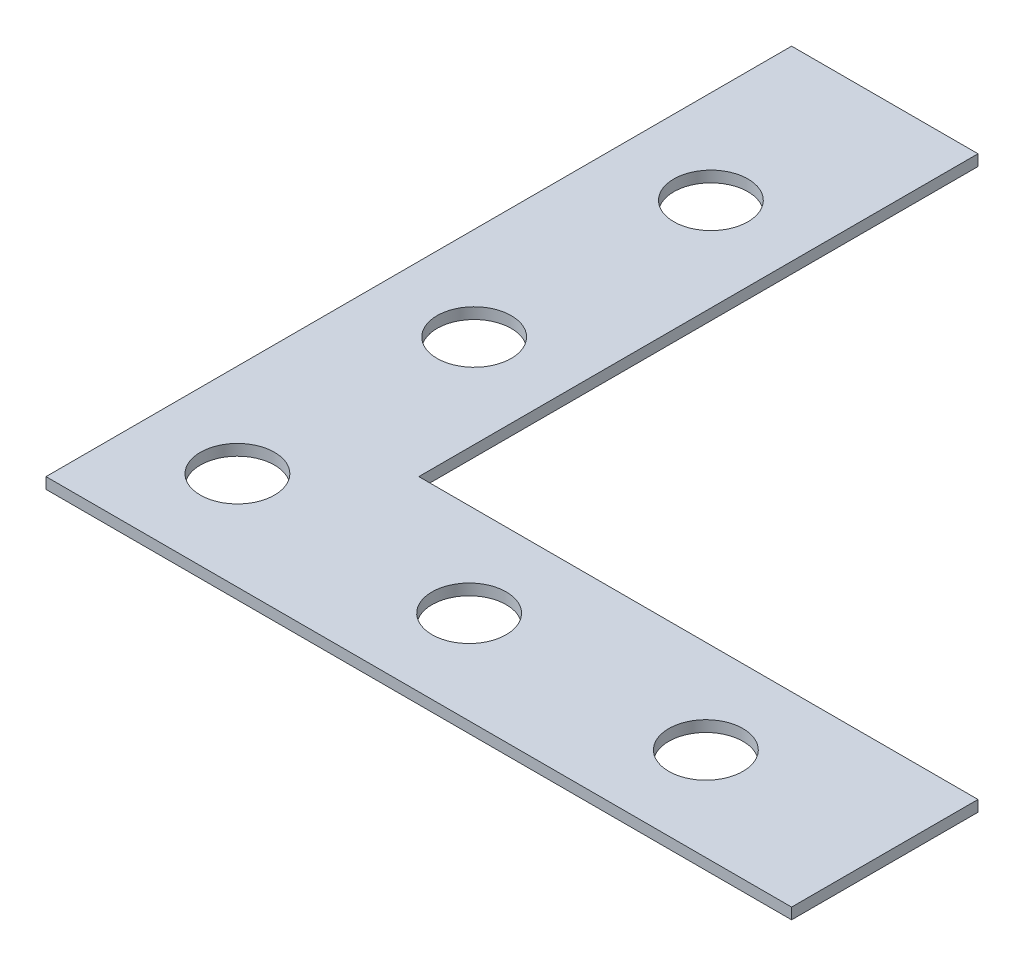
ISO-10303-21;
HEADER;
FILE_DESCRIPTION(('STEP AP214'),'2;1');
FILE_NAME('part.step','',(''),(''),'','','');
FILE_SCHEMA(('AUTOMOTIVE_DESIGN { 1 0 10303 214 1 1 1 1 }'));
ENDSEC;
DATA;
#1=APPLICATION_CONTEXT('core data for automotive mechanical design processes');
#2=APPLICATION_PROTOCOL_DEFINITION('international standard','automotive_design',2000,#1);
#3=PRODUCT_CONTEXT('',#1,'mechanical');
#4=PRODUCT('Part','Part','',(#3));
#5=PRODUCT_RELATED_PRODUCT_CATEGORY('part','',(#4));
#6=PRODUCT_DEFINITION_FORMATION('','',#4);
#7=PRODUCT_DEFINITION_CONTEXT('part definition',#1,'design');
#8=PRODUCT_DEFINITION('design','',#6,#7);
#9=PRODUCT_DEFINITION_SHAPE('','',#8);
#10=(LENGTH_UNIT() NAMED_UNIT(*) SI_UNIT(.MILLI.,.METRE.));
#11=(NAMED_UNIT(*) PLANE_ANGLE_UNIT() SI_UNIT($,.RADIAN.));
#12=(NAMED_UNIT(*) SI_UNIT($,.STERADIAN.) SOLID_ANGLE_UNIT());
#13=UNCERTAINTY_MEASURE_WITH_UNIT(LENGTH_MEASURE(1.E-05),#10,'distance_accuracy_value','');
#14=(GEOMETRIC_REPRESENTATION_CONTEXT(3) GLOBAL_UNCERTAINTY_ASSIGNED_CONTEXT((#13)) GLOBAL_UNIT_ASSIGNED_CONTEXT((#10,
#11,#12)) REPRESENTATION_CONTEXT('',''));
#15=CARTESIAN_POINT('',(0.,0.,0.));
#16=DIRECTION('',(0.,0.,1.));
#17=DIRECTION('',(1.,0.,0.));
#18=AXIS2_PLACEMENT_3D('',#15,#16,#17);
#19=CARTESIAN_POINT('',(0.,1.19,-80.));
#20=DIRECTION('',(0.,0.,-1.));
#21=DIRECTION('',(-1.,0.,0.));
#22=AXIS2_PLACEMENT_3D('',#19,#20,#21);
#23=PLANE('',#22);
#24=DIRECTION('',(1.,0.,0.));
#25=VECTOR('',#24,1.);
#26=CARTESIAN_POINT('',(0.,0.,-80.));
#27=LINE('',#26,#25);
#28=CARTESIAN_POINT('',(0.,0.,-80.));
#29=VERTEX_POINT('',#28);
#30=CARTESIAN_POINT('',(20.,0.,-80.));
#31=VERTEX_POINT('',#30);
#32=EDGE_CURVE('E136',#29,#31,#27,.T.);
#33=ORIENTED_EDGE('',*,*,#32,.F.);
#34=DIRECTION('',(0.,-1.,0.));
#35=VECTOR('',#34,1.);
#36=CARTESIAN_POINT('',(0.,1.19,-80.));
#37=LINE('',#36,#35);
#38=CARTESIAN_POINT('',(0.,1.19,-80.));
#39=VERTEX_POINT('',#38);
#40=EDGE_CURVE('E11',#39,#29,#37,.T.);
#41=ORIENTED_EDGE('',*,*,#40,.F.);
#42=DIRECTION('',(1.,0.,0.));
#43=VECTOR('',#42,1.);
#44=CARTESIAN_POINT('',(0.,1.19,-80.));
#45=LINE('',#44,#43);
#46=CARTESIAN_POINT('',(20.,1.19,-80.));
#47=VERTEX_POINT('',#46);
#48=EDGE_CURVE('E155',#39,#47,#45,.T.);
#49=ORIENTED_EDGE('',*,*,#48,.T.);
#50=DIRECTION('',(0.,-1.,0.));
#51=VECTOR('',#50,1.);
#52=CARTESIAN_POINT('',(20.,1.19,-80.));
#53=LINE('',#52,#51);
#54=EDGE_CURVE('E48',#47,#31,#53,.T.);
#55=ORIENTED_EDGE('',*,*,#54,.T.);
#56=EDGE_LOOP('',(#33,#41,#49,#55));
#57=FACE_BOUND('',#56,.T.);
#58=ADVANCED_FACE('F45',(#57),#23,.T.);
#59=CARTESIAN_POINT('',(0.,1.19,-80.));
#60=DIRECTION('',(1.,0.,0.));
#61=DIRECTION('',(0.,0.,-1.));
#62=AXIS2_PLACEMENT_3D('',#59,#60,#61);
#63=PLANE('',#62);
#64=DIRECTION('',(0.,0.,1.));
#65=VECTOR('',#64,1.);
#66=CARTESIAN_POINT('',(0.,0.,-80.));
#67=LINE('',#66,#65);
#68=CARTESIAN_POINT('',(0.,0.,0.));
#69=VERTEX_POINT('',#68);
#70=EDGE_CURVE('E85',#29,#69,#67,.T.);
#71=ORIENTED_EDGE('',*,*,#70,.T.);
#72=DIRECTION('',(0.,-1.,0.));
#73=VECTOR('',#72,1.);
#74=CARTESIAN_POINT('',(0.,1.19,0.));
#75=LINE('',#74,#73);
#76=CARTESIAN_POINT('',(0.,1.19,0.));
#77=VERTEX_POINT('',#76);
#78=EDGE_CURVE('E55',#77,#69,#75,.T.);
#79=ORIENTED_EDGE('',*,*,#78,.F.);
#80=DIRECTION('',(0.,0.,1.));
#81=VECTOR('',#80,1.);
#82=CARTESIAN_POINT('',(0.,1.19,-80.));
#83=LINE('',#82,#81);
#84=EDGE_CURVE('E110',#39,#77,#83,.T.);
#85=ORIENTED_EDGE('',*,*,#84,.F.);
#86=ORIENTED_EDGE('',*,*,#40,.T.);
#87=EDGE_LOOP('',(#71,#79,#85,#86));
#88=FACE_BOUND('',#87,.T.);
#89=ADVANCED_FACE('F250',(#88),#63,.F.);
#90=CARTESIAN_POINT('',(0.,1.19,0.));
#91=DIRECTION('',(0.,0.,-1.));
#92=DIRECTION('',(-1.,0.,0.));
#93=AXIS2_PLACEMENT_3D('',#90,#91,#92);
#94=PLANE('',#93);
#95=DIRECTION('',(1.,0.,0.));
#96=VECTOR('',#95,1.);
#97=CARTESIAN_POINT('',(0.,0.,0.));
#98=LINE('',#97,#96);
#99=CARTESIAN_POINT('',(80.,0.,0.));
#100=VERTEX_POINT('',#99);
#101=EDGE_CURVE('E118',#69,#100,#98,.T.);
#102=ORIENTED_EDGE('',*,*,#101,.T.);
#103=DIRECTION('',(0.,-1.,0.));
#104=VECTOR('',#103,1.);
#105=CARTESIAN_POINT('',(80.,1.19,0.));
#106=LINE('',#105,#104);
#107=CARTESIAN_POINT('',(80.,1.19,0.));
#108=VERTEX_POINT('',#107);
#109=EDGE_CURVE('E115',#108,#100,#106,.T.);
#110=ORIENTED_EDGE('',*,*,#109,.F.);
#111=DIRECTION('',(1.,0.,0.));
#112=VECTOR('',#111,1.);
#113=CARTESIAN_POINT('',(0.,1.19,0.));
#114=LINE('',#113,#112);
#115=EDGE_CURVE('E104',#77,#108,#114,.T.);
#116=ORIENTED_EDGE('',*,*,#115,.F.);
#117=ORIENTED_EDGE('',*,*,#78,.T.);
#118=EDGE_LOOP('',(#102,#110,#116,#117));
#119=FACE_BOUND('',#118,.T.);
#120=ADVANCED_FACE('F116',(#119),#94,.F.);
#121=CARTESIAN_POINT('',(80.,1.19,0.));
#122=DIRECTION('',(-1.,0.,0.));
#123=DIRECTION('',(0.,0.,1.));
#124=AXIS2_PLACEMENT_3D('',#121,#122,#123);
#125=PLANE('',#124);
#126=DIRECTION('',(0.,0.,-1.));
#127=VECTOR('',#126,1.);
#128=CARTESIAN_POINT('',(80.,0.,0.));
#129=LINE('',#128,#127);
#130=CARTESIAN_POINT('',(80.,0.,-20.));
#131=VERTEX_POINT('',#130);
#132=EDGE_CURVE('E149',#100,#131,#129,.T.);
#133=ORIENTED_EDGE('',*,*,#132,.T.);
#134=DIRECTION('',(0.,-1.,0.));
#135=VECTOR('',#134,1.);
#136=CARTESIAN_POINT('',(80.,1.19,-20.));
#137=LINE('',#136,#135);
#138=CARTESIAN_POINT('',(80.,1.19,-20.));
#139=VERTEX_POINT('',#138);
#140=EDGE_CURVE('E123',#139,#131,#137,.T.);
#141=ORIENTED_EDGE('',*,*,#140,.F.);
#142=DIRECTION('',(0.,0.,-1.));
#143=VECTOR('',#142,1.);
#144=CARTESIAN_POINT('',(80.,1.19,0.));
#145=LINE('',#144,#143);
#146=EDGE_CURVE('E108',#108,#139,#145,.T.);
#147=ORIENTED_EDGE('',*,*,#146,.F.);
#148=ORIENTED_EDGE('',*,*,#109,.T.);
#149=EDGE_LOOP('',(#133,#141,#147,#148));
#150=FACE_BOUND('',#149,.T.);
#151=ADVANCED_FACE('F125',(#150),#125,.F.);
#152=CARTESIAN_POINT('',(20.,1.19,-20.));
#153=DIRECTION('',(0.,0.,-1.));
#154=DIRECTION('',(-1.,0.,0.));
#155=AXIS2_PLACEMENT_3D('',#152,#153,#154);
#156=PLANE('',#155);
#157=DIRECTION('',(1.,0.,0.));
#158=VECTOR('',#157,1.);
#159=CARTESIAN_POINT('',(20.,0.,-20.));
#160=LINE('',#159,#158);
#161=CARTESIAN_POINT('',(20.,0.,-20.));
#162=VERTEX_POINT('',#161);
#163=EDGE_CURVE('E145',#162,#131,#160,.T.);
#164=ORIENTED_EDGE('',*,*,#163,.F.);
#165=DIRECTION('',(0.,-1.,0.));
#166=VECTOR('',#165,1.);
#167=CARTESIAN_POINT('',(20.,1.19,-20.));
#168=LINE('',#167,#166);
#169=CARTESIAN_POINT('',(20.,1.19,-20.));
#170=VERTEX_POINT('',#169);
#171=EDGE_CURVE('E160',#170,#162,#168,.T.);
#172=ORIENTED_EDGE('',*,*,#171,.F.);
#173=DIRECTION('',(1.,0.,0.));
#174=VECTOR('',#173,1.);
#175=CARTESIAN_POINT('',(20.,1.19,-20.));
#176=LINE('',#175,#174);
#177=EDGE_CURVE('E128',#170,#139,#176,.T.);
#178=ORIENTED_EDGE('',*,*,#177,.T.);
#179=ORIENTED_EDGE('',*,*,#140,.T.);
#180=EDGE_LOOP('',(#164,#172,#178,#179));
#181=FACE_BOUND('',#180,.T.);
#182=ADVANCED_FACE('F170',(#181),#156,.T.);
#183=CARTESIAN_POINT('',(20.,1.19,-20.));
#184=DIRECTION('',(-1.,0.,0.));
#185=DIRECTION('',(0.,0.,1.));
#186=AXIS2_PLACEMENT_3D('',#183,#184,#185);
#187=PLANE('',#186);
#188=DIRECTION('',(0.,0.,-1.));
#189=VECTOR('',#188,1.);
#190=CARTESIAN_POINT('',(20.,0.,-20.));
#191=LINE('',#190,#189);
#192=EDGE_CURVE('E140',#162,#31,#191,.T.);
#193=ORIENTED_EDGE('',*,*,#192,.T.);
#194=ORIENTED_EDGE('',*,*,#54,.F.);
#195=DIRECTION('',(0.,0.,-1.));
#196=VECTOR('',#195,1.);
#197=CARTESIAN_POINT('',(20.,1.19,-20.));
#198=LINE('',#197,#196);
#199=EDGE_CURVE('E95',#170,#47,#198,.T.);
#200=ORIENTED_EDGE('',*,*,#199,.F.);
#201=ORIENTED_EDGE('',*,*,#171,.T.);
#202=EDGE_LOOP('',(#193,#194,#200,#201));
#203=FACE_BOUND('',#202,.T.);
#204=ADVANCED_FACE('F165',(#203),#187,.F.);
#205=CARTESIAN_POINT('',(0.,1.19,0.));
#206=DIRECTION('',(0.,1.,0.));
#207=DIRECTION('',(0.,0.,1.));
#208=AXIS2_PLACEMENT_3D('',#205,#206,#207);
#209=PLANE('',#208);
#210=CARTESIAN_POINT('',(9.99999999999998,1.19,-61.34));
#211=DIRECTION('',(0.,1.,0.));
#212=DIRECTION('',(0.,0.,1.));
#213=AXIS2_PLACEMENT_3D('',#210,#211,#212);
#214=CIRCLE('',#213,3.97875);
#215=CARTESIAN_POINT('',(9.99999999999998,1.19,-57.36125));
#216=VERTEX_POINT('',#215);
#217=EDGE_CURVE('E207',#216,#216,#214,.T.);
#218=ORIENTED_EDGE('',*,*,#217,.F.);
#219=EDGE_LOOP('',(#218));
#220=FACE_BOUND('',#219,.T.);
#221=CARTESIAN_POINT('',(9.99999999999999,1.19,-35.94));
#222=DIRECTION('',(0.,1.,0.));
#223=DIRECTION('',(0.,0.,1.));
#224=AXIS2_PLACEMENT_3D('',#221,#222,#223);
#225=CIRCLE('',#224,3.98);
#226=CARTESIAN_POINT('',(9.99999999999999,1.19,-31.96));
#227=VERTEX_POINT('',#226);
#228=EDGE_CURVE('E203',#227,#227,#225,.T.);
#229=ORIENTED_EDGE('',*,*,#228,.F.);
#230=EDGE_LOOP('',(#229));
#231=FACE_BOUND('',#230,.T.);
#232=CARTESIAN_POINT('',(9.99999999999999,1.19,-10.54));
#233=DIRECTION('',(0.,1.,0.));
#234=DIRECTION('',(0.,0.,1.));
#235=AXIS2_PLACEMENT_3D('',#232,#233,#234);
#236=CIRCLE('',#235,3.98);
#237=CARTESIAN_POINT('',(9.99999999999999,1.19,-6.56));
#238=VERTEX_POINT('',#237);
#239=EDGE_CURVE('E195',#238,#238,#236,.T.);
#240=ORIENTED_EDGE('',*,*,#239,.F.);
#241=EDGE_LOOP('',(#240));
#242=FACE_BOUND('',#241,.T.);
#243=CARTESIAN_POINT('',(35.4,1.19,-10.));
#244=DIRECTION('',(0.,1.,0.));
#245=DIRECTION('',(0.,0.,1.));
#246=AXIS2_PLACEMENT_3D('',#243,#244,#245);
#247=CIRCLE('',#246,3.98);
#248=CARTESIAN_POINT('',(35.4,1.19,-6.02));
#249=VERTEX_POINT('',#248);
#250=EDGE_CURVE('E187',#249,#249,#247,.T.);
#251=ORIENTED_EDGE('',*,*,#250,.F.);
#252=EDGE_LOOP('',(#251));
#253=FACE_BOUND('',#252,.T.);
#254=CARTESIAN_POINT('',(60.8,1.19,-10.));
#255=DIRECTION('',(0.,1.,0.));
#256=DIRECTION('',(0.,0.,1.));
#257=AXIS2_PLACEMENT_3D('',#254,#255,#256);
#258=CIRCLE('',#257,3.98000000000001);
#259=CARTESIAN_POINT('',(60.8,1.19,-6.01999999999999));
#260=VERTEX_POINT('',#259);
#261=EDGE_CURVE('E179',#260,#260,#258,.T.);
#262=ORIENTED_EDGE('',*,*,#261,.F.);
#263=EDGE_LOOP('',(#262));
#264=FACE_BOUND('',#263,.T.);
#265=ORIENTED_EDGE('',*,*,#48,.F.);
#266=ORIENTED_EDGE('',*,*,#84,.T.);
#267=ORIENTED_EDGE('',*,*,#115,.T.);
#268=ORIENTED_EDGE('',*,*,#146,.T.);
#269=ORIENTED_EDGE('',*,*,#177,.F.);
#270=ORIENTED_EDGE('',*,*,#199,.T.);
#271=EDGE_LOOP('',(#265,#266,#267,#268,#269,#270));
#272=FACE_BOUND('',#271,.T.);
#273=ADVANCED_FACE('F106',(#220,#231,#242,#253,#264,#272),#209,.T.);
#274=CARTESIAN_POINT('',(0.,0.,0.));
#275=DIRECTION('',(0.,1.,0.));
#276=DIRECTION('',(0.,0.,1.));
#277=AXIS2_PLACEMENT_3D('',#274,#275,#276);
#278=PLANE('',#277);
#279=CARTESIAN_POINT('',(9.99999999999998,0.,-61.34));
#280=DIRECTION('',(0.,1.,0.));
#281=DIRECTION('',(0.,0.,1.));
#282=AXIS2_PLACEMENT_3D('',#279,#280,#281);
#283=CIRCLE('',#282,3.97875);
#284=CARTESIAN_POINT('',(9.99999999999998,0.,-57.36125));
#285=VERTEX_POINT('',#284);
#286=EDGE_CURVE('E141',#285,#285,#283,.T.);
#287=ORIENTED_EDGE('',*,*,#286,.T.);
#288=EDGE_LOOP('',(#287));
#289=FACE_BOUND('',#288,.T.);
#290=CARTESIAN_POINT('',(9.99999999999999,0.,-35.94));
#291=DIRECTION('',(0.,1.,0.));
#292=DIRECTION('',(0.,0.,1.));
#293=AXIS2_PLACEMENT_3D('',#290,#291,#292);
#294=CIRCLE('',#293,3.98);
#295=CARTESIAN_POINT('',(9.99999999999999,0.,-31.96));
#296=VERTEX_POINT('',#295);
#297=EDGE_CURVE('E199',#296,#296,#294,.T.);
#298=ORIENTED_EDGE('',*,*,#297,.T.);
#299=EDGE_LOOP('',(#298));
#300=FACE_BOUND('',#299,.T.);
#301=CARTESIAN_POINT('',(9.99999999999999,0.,-10.54));
#302=DIRECTION('',(0.,1.,0.));
#303=DIRECTION('',(0.,0.,1.));
#304=AXIS2_PLACEMENT_3D('',#301,#302,#303);
#305=CIRCLE('',#304,3.98);
#306=CARTESIAN_POINT('',(9.99999999999999,0.,-6.56));
#307=VERTEX_POINT('',#306);
#308=EDGE_CURVE('E191',#307,#307,#305,.T.);
#309=ORIENTED_EDGE('',*,*,#308,.T.);
#310=EDGE_LOOP('',(#309));
#311=FACE_BOUND('',#310,.T.);
#312=CARTESIAN_POINT('',(35.4,0.,-10.));
#313=DIRECTION('',(0.,1.,0.));
#314=DIRECTION('',(0.,0.,1.));
#315=AXIS2_PLACEMENT_3D('',#312,#313,#314);
#316=CIRCLE('',#315,3.98);
#317=CARTESIAN_POINT('',(35.4,0.,-6.02));
#318=VERTEX_POINT('',#317);
#319=EDGE_CURVE('E183',#318,#318,#316,.T.);
#320=ORIENTED_EDGE('',*,*,#319,.T.);
#321=EDGE_LOOP('',(#320));
#322=FACE_BOUND('',#321,.T.);
#323=CARTESIAN_POINT('',(60.8,0.,-10.));
#324=DIRECTION('',(0.,1.,0.));
#325=DIRECTION('',(0.,0.,1.));
#326=AXIS2_PLACEMENT_3D('',#323,#324,#325);
#327=CIRCLE('',#326,3.98000000000001);
#328=CARTESIAN_POINT('',(60.8,0.,-6.01999999999999));
#329=VERTEX_POINT('',#328);
#330=EDGE_CURVE('E175',#329,#329,#327,.T.);
#331=ORIENTED_EDGE('',*,*,#330,.T.);
#332=EDGE_LOOP('',(#331));
#333=FACE_BOUND('',#332,.T.);
#334=ORIENTED_EDGE('',*,*,#32,.T.);
#335=ORIENTED_EDGE('',*,*,#192,.F.);
#336=ORIENTED_EDGE('',*,*,#163,.T.);
#337=ORIENTED_EDGE('',*,*,#132,.F.);
#338=ORIENTED_EDGE('',*,*,#101,.F.);
#339=ORIENTED_EDGE('',*,*,#70,.F.);
#340=EDGE_LOOP('',(#334,#335,#336,#337,#338,#339));
#341=FACE_BOUND('',#340,.T.);
#342=ADVANCED_FACE('F168',(#289,#300,#311,#322,#333,#341),#278,.F.);
#343=CARTESIAN_POINT('',(60.8,0.,-10.));
#344=DIRECTION('',(0.,1.,0.));
#345=DIRECTION('',(0.,0.,1.));
#346=AXIS2_PLACEMENT_3D('',#343,#344,#345);
#347=CYLINDRICAL_SURFACE('',#346,3.98000000000001);
#348=ORIENTED_EDGE('',*,*,#330,.F.);
#349=EDGE_LOOP('',(#348));
#350=FACE_BOUND('',#349,.T.);
#351=ORIENTED_EDGE('',*,*,#261,.T.);
#352=EDGE_LOOP('',(#351));
#353=FACE_BOUND('',#352,.T.);
#354=ADVANCED_FACE('F235',(#350,#353),#347,.F.);
#355=CARTESIAN_POINT('',(35.4,0.,-10.));
#356=DIRECTION('',(0.,1.,0.));
#357=DIRECTION('',(0.,0.,1.));
#358=AXIS2_PLACEMENT_3D('',#355,#356,#357);
#359=CYLINDRICAL_SURFACE('',#358,3.98);
#360=ORIENTED_EDGE('',*,*,#319,.F.);
#361=EDGE_LOOP('',(#360));
#362=FACE_BOUND('',#361,.T.);
#363=ORIENTED_EDGE('',*,*,#250,.T.);
#364=EDGE_LOOP('',(#363));
#365=FACE_BOUND('',#364,.T.);
#366=ADVANCED_FACE('F237',(#362,#365),#359,.F.);
#367=CARTESIAN_POINT('',(9.99999999999999,0.,-10.54));
#368=DIRECTION('',(0.,1.,0.));
#369=DIRECTION('',(0.,0.,1.));
#370=AXIS2_PLACEMENT_3D('',#367,#368,#369);
#371=CYLINDRICAL_SURFACE('',#370,3.98);
#372=ORIENTED_EDGE('',*,*,#308,.F.);
#373=EDGE_LOOP('',(#372));
#374=FACE_BOUND('',#373,.T.);
#375=ORIENTED_EDGE('',*,*,#239,.T.);
#376=EDGE_LOOP('',(#375));
#377=FACE_BOUND('',#376,.T.);
#378=ADVANCED_FACE('F244',(#374,#377),#371,.F.);
#379=CARTESIAN_POINT('',(9.99999999999999,0.,-35.94));
#380=DIRECTION('',(0.,1.,0.));
#381=DIRECTION('',(0.,0.,1.));
#382=AXIS2_PLACEMENT_3D('',#379,#380,#381);
#383=CYLINDRICAL_SURFACE('',#382,3.98);
#384=ORIENTED_EDGE('',*,*,#297,.F.);
#385=EDGE_LOOP('',(#384));
#386=FACE_BOUND('',#385,.T.);
#387=ORIENTED_EDGE('',*,*,#228,.T.);
#388=EDGE_LOOP('',(#387));
#389=FACE_BOUND('',#388,.T.);
#390=ADVANCED_FACE('F220',(#386,#389),#383,.F.);
#391=CARTESIAN_POINT('',(9.99999999999998,0.,-61.34));
#392=DIRECTION('',(0.,1.,0.));
#393=DIRECTION('',(0.,0.,1.));
#394=AXIS2_PLACEMENT_3D('',#391,#392,#393);
#395=CYLINDRICAL_SURFACE('',#394,3.97875);
#396=ORIENTED_EDGE('',*,*,#286,.F.);
#397=EDGE_LOOP('',(#396));
#398=FACE_BOUND('',#397,.T.);
#399=ORIENTED_EDGE('',*,*,#217,.T.);
#400=EDGE_LOOP('',(#399));
#401=FACE_BOUND('',#400,.T.);
#402=ADVANCED_FACE('F217',(#398,#401),#395,.F.);
#403=CLOSED_SHELL('',(#58,#89,#120,#151,#182,#204,#273,#342,#354,#366,#378,#390,#402));
#404=MANIFOLD_SOLID_BREP('B2',#403);
#405=ADVANCED_BREP_SHAPE_REPRESENTATION('',(#18,#404),#14);
#406=SHAPE_DEFINITION_REPRESENTATION(#9,#405);
ENDSEC;
END-ISO-10303-21;
